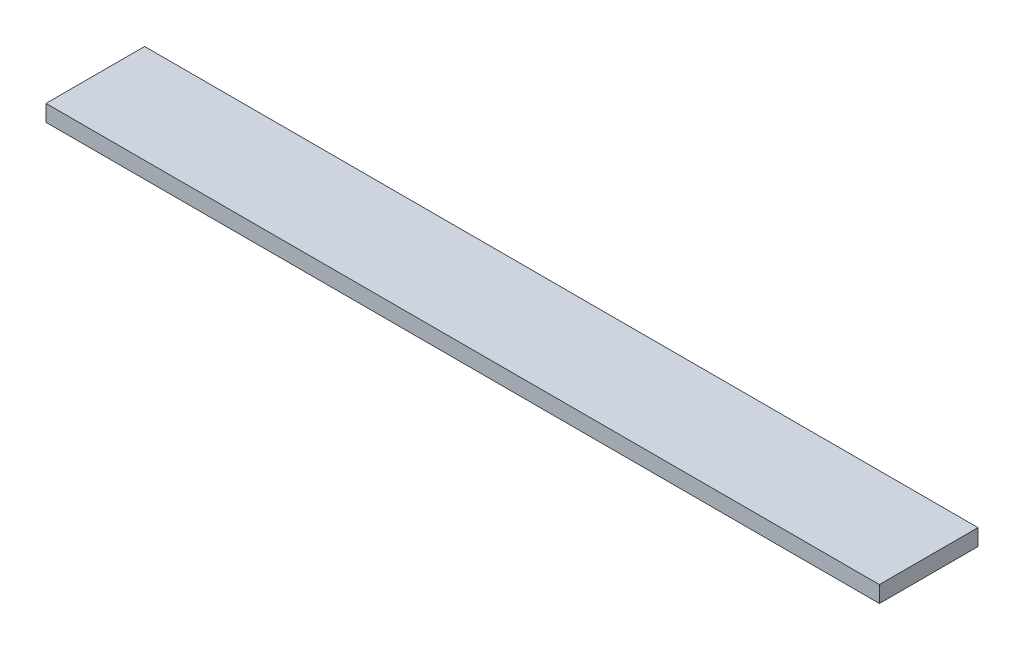
ISO-10303-21;
HEADER;
FILE_DESCRIPTION(('STEP AP214'),'2;1');
FILE_NAME('part.step','',(''),(''),'','','');
FILE_SCHEMA(('AUTOMOTIVE_DESIGN { 1 0 10303 214 1 1 1 1 }'));
ENDSEC;
DATA;
#1=APPLICATION_CONTEXT('core data for automotive mechanical design processes');
#2=APPLICATION_PROTOCOL_DEFINITION('international standard','automotive_design',2000,#1);
#3=PRODUCT_CONTEXT('',#1,'mechanical');
#4=PRODUCT('Part','Part','',(#3));
#5=PRODUCT_RELATED_PRODUCT_CATEGORY('part','',(#4));
#6=PRODUCT_DEFINITION_FORMATION('','',#4);
#7=PRODUCT_DEFINITION_CONTEXT('part definition',#1,'design');
#8=PRODUCT_DEFINITION('design','',#6,#7);
#9=PRODUCT_DEFINITION_SHAPE('','',#8);
#10=(LENGTH_UNIT() NAMED_UNIT(*) SI_UNIT(.MILLI.,.METRE.));
#11=(NAMED_UNIT(*) PLANE_ANGLE_UNIT() SI_UNIT($,.RADIAN.));
#12=(NAMED_UNIT(*) SI_UNIT($,.STERADIAN.) SOLID_ANGLE_UNIT());
#13=UNCERTAINTY_MEASURE_WITH_UNIT(LENGTH_MEASURE(1.E-05),#10,'distance_accuracy_value','');
#14=(GEOMETRIC_REPRESENTATION_CONTEXT(3) GLOBAL_UNCERTAINTY_ASSIGNED_CONTEXT((#13)) GLOBAL_UNIT_ASSIGNED_CONTEXT((#10,
#11,#12)) REPRESENTATION_CONTEXT('',''));
#15=CARTESIAN_POINT('',(0.,0.,0.));
#16=DIRECTION('',(0.,0.,1.));
#17=DIRECTION('',(1.,0.,0.));
#18=AXIS2_PLACEMENT_3D('',#15,#16,#17);
#19=CARTESIAN_POINT('',(322.,-6.35,38.1));
#20=DIRECTION('',(0.,0.,-1.));
#21=DIRECTION('',(-1.,0.,0.));
#22=AXIS2_PLACEMENT_3D('',#19,#20,#21);
#23=PLANE('',#22);
#24=DIRECTION('',(0.,-1.,0.));
#25=VECTOR('',#24,1.);
#26=CARTESIAN_POINT('',(0.,-6.35,38.1));
#27=LINE('',#26,#25);
#28=CARTESIAN_POINT('',(0.,0.,38.1));
#29=VERTEX_POINT('',#28);
#30=CARTESIAN_POINT('',(0.,-6.35,38.1));
#31=VERTEX_POINT('',#30);
#32=EDGE_CURVE('E96',#29,#31,#27,.T.);
#33=ORIENTED_EDGE('',*,*,#32,.T.);
#34=DIRECTION('',(-1.,0.,0.));
#35=VECTOR('',#34,1.);
#36=CARTESIAN_POINT('',(322.,-6.35,38.1));
#37=LINE('',#36,#35);
#38=CARTESIAN_POINT('',(322.,-6.35,38.1));
#39=VERTEX_POINT('',#38);
#40=EDGE_CURVE('E11',#39,#31,#37,.T.);
#41=ORIENTED_EDGE('',*,*,#40,.F.);
#42=DIRECTION('',(0.,-1.,0.));
#43=VECTOR('',#42,1.);
#44=CARTESIAN_POINT('',(322.,-6.35,38.1));
#45=LINE('',#44,#43);
#46=CARTESIAN_POINT('',(322.,0.,38.1));
#47=VERTEX_POINT('',#46);
#48=EDGE_CURVE('E84',#47,#39,#45,.T.);
#49=ORIENTED_EDGE('',*,*,#48,.F.);
#50=DIRECTION('',(-1.,0.,0.));
#51=VECTOR('',#50,1.);
#52=CARTESIAN_POINT('',(322.,0.,38.1));
#53=LINE('',#52,#51);
#54=EDGE_CURVE('E92',#47,#29,#53,.T.);
#55=ORIENTED_EDGE('',*,*,#54,.T.);
#56=EDGE_LOOP('',(#33,#41,#49,#55));
#57=FACE_BOUND('',#56,.T.);
#58=ADVANCED_FACE('F33',(#57),#23,.F.);
#59=CARTESIAN_POINT('',(322.,-6.35,0.));
#60=DIRECTION('',(0.,1.,0.));
#61=DIRECTION('',(0.,0.,1.));
#62=AXIS2_PLACEMENT_3D('',#59,#60,#61);
#63=PLANE('',#62);
#64=DIRECTION('',(0.,0.,-1.));
#65=VECTOR('',#64,1.);
#66=CARTESIAN_POINT('',(0.,-6.35,0.));
#67=LINE('',#66,#65);
#68=CARTESIAN_POINT('',(0.,-6.35,0.));
#69=VERTEX_POINT('',#68);
#70=EDGE_CURVE('E88',#31,#69,#67,.T.);
#71=ORIENTED_EDGE('',*,*,#70,.T.);
#72=DIRECTION('',(-1.,0.,0.));
#73=VECTOR('',#72,1.);
#74=CARTESIAN_POINT('',(322.,-6.35,0.));
#75=LINE('',#74,#73);
#76=CARTESIAN_POINT('',(322.,-6.35,0.));
#77=VERTEX_POINT('',#76);
#78=EDGE_CURVE('E41',#77,#69,#75,.T.);
#79=ORIENTED_EDGE('',*,*,#78,.F.);
#80=DIRECTION('',(0.,0.,-1.));
#81=VECTOR('',#80,1.);
#82=CARTESIAN_POINT('',(322.,-6.35,0.));
#83=LINE('',#82,#81);
#84=EDGE_CURVE('E79',#39,#77,#83,.T.);
#85=ORIENTED_EDGE('',*,*,#84,.F.);
#86=ORIENTED_EDGE('',*,*,#40,.T.);
#87=EDGE_LOOP('',(#71,#79,#85,#86));
#88=FACE_BOUND('',#87,.T.);
#89=ADVANCED_FACE('F87',(#88),#63,.F.);
#90=CARTESIAN_POINT('',(322.,-6.35,0.));
#91=DIRECTION('',(0.,0.,1.));
#92=DIRECTION('',(1.,0.,0.));
#93=AXIS2_PLACEMENT_3D('',#90,#91,#92);
#94=PLANE('',#93);
#95=DIRECTION('',(0.,1.,0.));
#96=VECTOR('',#95,1.);
#97=CARTESIAN_POINT('',(0.,-6.35,0.));
#98=LINE('',#97,#96);
#99=CARTESIAN_POINT('',(0.,0.,0.));
#100=VERTEX_POINT('',#99);
#101=EDGE_CURVE('E66',#69,#100,#98,.T.);
#102=ORIENTED_EDGE('',*,*,#101,.T.);
#103=DIRECTION('',(-1.,0.,0.));
#104=VECTOR('',#103,1.);
#105=CARTESIAN_POINT('',(322.,0.,0.));
#106=LINE('',#105,#104);
#107=CARTESIAN_POINT('',(322.,0.,0.));
#108=VERTEX_POINT('',#107);
#109=EDGE_CURVE('E89',#108,#100,#106,.T.);
#110=ORIENTED_EDGE('',*,*,#109,.F.);
#111=DIRECTION('',(0.,1.,0.));
#112=VECTOR('',#111,1.);
#113=CARTESIAN_POINT('',(322.,-6.35,0.));
#114=LINE('',#113,#112);
#115=EDGE_CURVE('E82',#77,#108,#114,.T.);
#116=ORIENTED_EDGE('',*,*,#115,.F.);
#117=ORIENTED_EDGE('',*,*,#78,.T.);
#118=EDGE_LOOP('',(#102,#110,#116,#117));
#119=FACE_BOUND('',#118,.T.);
#120=ADVANCED_FACE('F90',(#119),#94,.F.);
#121=CARTESIAN_POINT('',(322.,0.,0.));
#122=DIRECTION('',(0.,-1.,0.));
#123=DIRECTION('',(0.,0.,-1.));
#124=AXIS2_PLACEMENT_3D('',#121,#122,#123);
#125=PLANE('',#124);
#126=DIRECTION('',(0.,0.,1.));
#127=VECTOR('',#126,1.);
#128=CARTESIAN_POINT('',(0.,0.,0.));
#129=LINE('',#128,#127);
#130=EDGE_CURVE('E72',#100,#29,#129,.T.);
#131=ORIENTED_EDGE('',*,*,#130,.T.);
#132=ORIENTED_EDGE('',*,*,#54,.F.);
#133=DIRECTION('',(0.,0.,1.));
#134=VECTOR('',#133,1.);
#135=CARTESIAN_POINT('',(322.,0.,0.));
#136=LINE('',#135,#134);
#137=EDGE_CURVE('E49',#108,#47,#136,.T.);
#138=ORIENTED_EDGE('',*,*,#137,.F.);
#139=ORIENTED_EDGE('',*,*,#109,.T.);
#140=EDGE_LOOP('',(#131,#132,#138,#139));
#141=FACE_BOUND('',#140,.T.);
#142=ADVANCED_FACE('F103',(#141),#125,.F.);
#143=CARTESIAN_POINT('',(322.,0.,0.));
#144=DIRECTION('',(1.,0.,0.));
#145=DIRECTION('',(0.,0.,-1.));
#146=AXIS2_PLACEMENT_3D('',#143,#144,#145);
#147=PLANE('',#146);
#148=ORIENTED_EDGE('',*,*,#48,.T.);
#149=ORIENTED_EDGE('',*,*,#84,.T.);
#150=ORIENTED_EDGE('',*,*,#115,.T.);
#151=ORIENTED_EDGE('',*,*,#137,.T.);
#152=EDGE_LOOP('',(#148,#149,#150,#151));
#153=FACE_BOUND('',#152,.T.);
#154=ADVANCED_FACE('F80',(#153),#147,.T.);
#155=CARTESIAN_POINT('',(0.,0.,0.));
#156=DIRECTION('',(1.,0.,0.));
#157=DIRECTION('',(0.,0.,-1.));
#158=AXIS2_PLACEMENT_3D('',#155,#156,#157);
#159=PLANE('',#158);
#160=ORIENTED_EDGE('',*,*,#32,.F.);
#161=ORIENTED_EDGE('',*,*,#130,.F.);
#162=ORIENTED_EDGE('',*,*,#101,.F.);
#163=ORIENTED_EDGE('',*,*,#70,.F.);
#164=EDGE_LOOP('',(#160,#161,#162,#163));
#165=FACE_BOUND('',#164,.T.);
#166=ADVANCED_FACE('F106',(#165),#159,.F.);
#167=CLOSED_SHELL('',(#58,#89,#120,#142,#154,#166));
#168=MANIFOLD_SOLID_BREP('B2',#167);
#169=ADVANCED_BREP_SHAPE_REPRESENTATION('',(#18,#168),#14);
#170=SHAPE_DEFINITION_REPRESENTATION(#9,#169);
ENDSEC;
END-ISO-10303-21;
